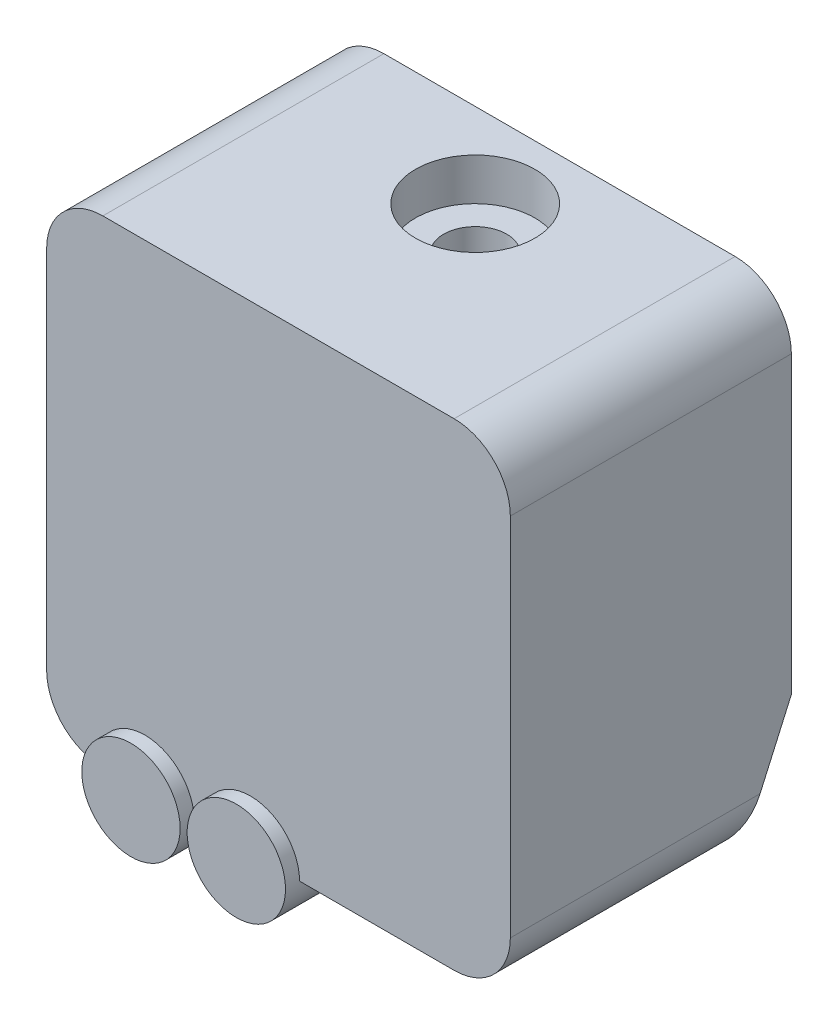
ISO-10303-21;
HEADER;
FILE_DESCRIPTION(('STEP AP214'),'2;1');
FILE_NAME('part.step','',(''),(''),'','','');
FILE_SCHEMA(('AUTOMOTIVE_DESIGN { 1 0 10303 214 1 1 1 1 }'));
ENDSEC;
DATA;
#1=APPLICATION_CONTEXT('core data for automotive mechanical design processes');
#2=APPLICATION_PROTOCOL_DEFINITION('international standard','automotive_design',2000,#1);
#3=PRODUCT_CONTEXT('',#1,'mechanical');
#4=PRODUCT('Part','Part','',(#3));
#5=PRODUCT_RELATED_PRODUCT_CATEGORY('part','',(#4));
#6=PRODUCT_DEFINITION_FORMATION('','',#4);
#7=PRODUCT_DEFINITION_CONTEXT('part definition',#1,'design');
#8=PRODUCT_DEFINITION('design','',#6,#7);
#9=PRODUCT_DEFINITION_SHAPE('','',#8);
#10=(LENGTH_UNIT() NAMED_UNIT(*) SI_UNIT(.MILLI.,.METRE.));
#11=(NAMED_UNIT(*) PLANE_ANGLE_UNIT() SI_UNIT($,.RADIAN.));
#12=(NAMED_UNIT(*) SI_UNIT($,.STERADIAN.) SOLID_ANGLE_UNIT());
#13=UNCERTAINTY_MEASURE_WITH_UNIT(LENGTH_MEASURE(1.E-05),#10,'distance_accuracy_value','');
#14=(GEOMETRIC_REPRESENTATION_CONTEXT(3) GLOBAL_UNCERTAINTY_ASSIGNED_CONTEXT((#13)) GLOBAL_UNIT_ASSIGNED_CONTEXT((#10,
#11,#12)) REPRESENTATION_CONTEXT('',''));
#15=CARTESIAN_POINT('',(0.,0.,0.));
#16=DIRECTION('',(0.,0.,1.));
#17=DIRECTION('',(1.,0.,0.));
#18=AXIS2_PLACEMENT_3D('',#15,#16,#17);
#19=CARTESIAN_POINT('',(0.,60.499,-18.));
#20=DIRECTION('',(0.,1.,0.));
#21=DIRECTION('',(0.,0.,1.));
#22=AXIS2_PLACEMENT_3D('',#19,#20,#21);
#23=CYLINDRICAL_SURFACE('',#22,2.25);
#24=CARTESIAN_POINT('',(0.,93.,-18.));
#25=DIRECTION('',(0.,1.,0.));
#26=DIRECTION('',(0.,0.,1.));
#27=AXIS2_PLACEMENT_3D('',#24,#25,#26);
#28=CIRCLE('',#27,2.25);
#29=CARTESIAN_POINT('',(0.,93.,-15.75));
#30=VERTEX_POINT('',#29);
#31=EDGE_CURVE('E574',#30,#30,#28,.F.);
#32=ORIENTED_EDGE('',*,*,#31,.T.);
#33=EDGE_LOOP('',(#32));
#34=FACE_BOUND('',#33,.T.);
#35=CARTESIAN_POINT('',(0.,95.,-18.));
#36=DIRECTION('',(0.,1.,0.));
#37=DIRECTION('',(0.,0.,1.));
#38=AXIS2_PLACEMENT_3D('',#35,#36,#37);
#39=CIRCLE('',#38,2.25);
#40=CARTESIAN_POINT('',(0.,95.,-15.75));
#41=VERTEX_POINT('',#40);
#42=EDGE_CURVE('E43',#41,#41,#39,.F.);
#43=ORIENTED_EDGE('',*,*,#42,.F.);
#44=EDGE_LOOP('',(#43));
#45=FACE_BOUND('',#44,.T.);
#46=ADVANCED_FACE('F39',(#34,#45),#23,.F.);
#47=CARTESIAN_POINT('',(-50.1130151648151,73.,-24.));
#48=DIRECTION('',(0.,0.406736643075801,0.913545457642601));
#49=DIRECTION('',(0.,-0.913545457642601,0.406736643075801));
#50=AXIS2_PLACEMENT_3D('',#47,#48,#49);
#51=PLANE('',#50);
#52=DIRECTION('',(1.,0.,0.));
#53=VECTOR('',#52,1.);
#54=CARTESIAN_POINT('',(-50.1130151648151,69.,-22.2190852587658));
#55=LINE('',#54,#53);
#56=CARTESIAN_POINT('',(-11.5,69.,-22.2190852587658));
#57=VERTEX_POINT('',#56);
#58=CARTESIAN_POINT('',(11.5,69.,-22.2190852587658));
#59=VERTEX_POINT('',#58);
#60=EDGE_CURVE('E13',#57,#59,#55,.T.);
#61=ORIENTED_EDGE('',*,*,#60,.T.);
#62=DIRECTION('',(0.,0.913545457642601,-0.406736643075801));
#63=VECTOR('',#62,1.);
#64=CARTESIAN_POINT('',(11.5,73.,-24.));
#65=LINE('',#64,#63);
#66=CARTESIAN_POINT('',(11.5,73.,-24.));
#67=VERTEX_POINT('',#66);
#68=EDGE_CURVE('E177',#59,#67,#65,.T.);
#69=ORIENTED_EDGE('',*,*,#68,.T.);
#70=DIRECTION('',(1.,0.,0.));
#71=VECTOR('',#70,1.);
#72=CARTESIAN_POINT('',(-50.1130151648151,73.,-24.));
#73=LINE('',#72,#71);
#74=CARTESIAN_POINT('',(16.5,73.,-24.));
#75=VERTEX_POINT('',#74);
#76=EDGE_CURVE('E213',#67,#75,#73,.T.);
#77=ORIENTED_EDGE('',*,*,#76,.T.);
#78=DIRECTION('',(0.,-0.913545457642601,0.406736643075801));
#79=VECTOR('',#78,1.);
#80=CARTESIAN_POINT('',(16.5,73.,-24.));
#81=LINE('',#80,#79);
#82=CARTESIAN_POINT('',(16.5,68.,-21.7738565734573));
#83=VERTEX_POINT('',#82);
#84=EDGE_CURVE('E204',#75,#83,#81,.T.);
#85=ORIENTED_EDGE('',*,*,#84,.T.);
#86=CARTESIAN_POINT('',(12.5,68.,-21.7738565734573));
#87=DIRECTION('',(0.,-0.406736643075801,-0.9135454576426));
#88=DIRECTION('',(0.,0.913545457642601,-0.406736643075801));
#89=AXIS2_PLACEMENT_3D('',#86,#87,#88);
#90=ELLIPSE('',#89,4.37854511402419,4.);
#91=CARTESIAN_POINT('',(12.5,64.,-19.9929418322231));
#92=VERTEX_POINT('',#91);
#93=EDGE_CURVE('E216',#92,#83,#90,.F.);
#94=ORIENTED_EDGE('',*,*,#93,.F.);
#95=DIRECTION('',(-1.,0.,0.));
#96=VECTOR('',#95,1.);
#97=CARTESIAN_POINT('',(-16.5,64.,-19.9929418322231));
#98=LINE('',#97,#96);
#99=CARTESIAN_POINT('',(1.5,64.,-19.9929418322231));
#100=VERTEX_POINT('',#99);
#101=EDGE_CURVE('E219',#92,#100,#98,.T.);
#102=ORIENTED_EDGE('',*,*,#101,.T.);
#103=CARTESIAN_POINT('',(-2.00000000000001,64.,-19.9929418322231));
#104=DIRECTION('',(0.,-0.406736643075801,-0.9135454576426));
#105=DIRECTION('',(0.,0.913545457642601,-0.406736643075801));
#106=AXIS2_PLACEMENT_3D('',#103,#104,#105);
#107=ELLIPSE('',#106,3.83122697477117,3.50000000000001);
#108=CARTESIAN_POINT('',(-5.50000000000001,64.,-19.9929418322231));
#109=VERTEX_POINT('',#108);
#110=EDGE_CURVE('E221',#100,#109,#107,.T.);
#111=ORIENTED_EDGE('',*,*,#110,.T.);
#112=DIRECTION('',(-1.,0.,0.));
#113=VECTOR('',#112,1.);
#114=CARTESIAN_POINT('',(-16.5,64.,-19.9929418322231));
#115=LINE('',#114,#113);
#116=CARTESIAN_POINT('',(-6.,64.,-19.9929418322231));
#117=VERTEX_POINT('',#116);
#118=EDGE_CURVE('E223',#109,#117,#115,.T.);
#119=ORIENTED_EDGE('',*,*,#118,.T.);
#120=CARTESIAN_POINT('',(-9.50000000000001,64.,-19.9929418322231));
#121=DIRECTION('',(0.,-0.406736643075801,-0.9135454576426));
#122=DIRECTION('',(0.,0.913545457642601,-0.406736643075801));
#123=AXIS2_PLACEMENT_3D('',#120,#121,#122);
#124=ELLIPSE('',#123,3.83122697477117,3.5);
#125=CARTESIAN_POINT('',(-12.9998595461287,64.0313553404035,-20.0069021292084));
#126=VERTEX_POINT('',#125);
#127=EDGE_CURVE('E225',#117,#126,#124,.T.);
#128=ORIENTED_EDGE('',*,*,#127,.T.);
#129=CARTESIAN_POINT('',(-12.5,68.,-21.7738565734573));
#130=DIRECTION('',(0.,-0.406736643075801,-0.9135454576426));
#131=DIRECTION('',(0.,0.913545457642601,-0.406736643075801));
#132=AXIS2_PLACEMENT_3D('',#129,#130,#131);
#133=ELLIPSE('',#132,4.37854511402419,4.);
#134=CARTESIAN_POINT('',(-16.5,68.,-21.7738565734573));
#135=VERTEX_POINT('',#134);
#136=EDGE_CURVE('E227',#135,#126,#133,.F.);
#137=ORIENTED_EDGE('',*,*,#136,.F.);
#138=DIRECTION('',(0.,0.913545457642601,-0.406736643075801));
#139=VECTOR('',#138,1.);
#140=CARTESIAN_POINT('',(-16.5,73.,-24.));
#141=LINE('',#140,#139);
#142=CARTESIAN_POINT('',(-16.5,73.,-24.));
#143=VERTEX_POINT('',#142);
#144=EDGE_CURVE('E210',#135,#143,#141,.T.);
#145=ORIENTED_EDGE('',*,*,#144,.T.);
#146=CARTESIAN_POINT('',(-11.5,73.,-24.));
#147=VERTEX_POINT('',#146);
#148=EDGE_CURVE('E215',#143,#147,#73,.T.);
#149=ORIENTED_EDGE('',*,*,#148,.T.);
#150=DIRECTION('',(0.,-0.913545457642601,0.406736643075801));
#151=VECTOR('',#150,1.);
#152=CARTESIAN_POINT('',(-11.5,73.,-24.));
#153=LINE('',#152,#151);
#154=EDGE_CURVE('E197',#147,#57,#153,.T.);
#155=ORIENTED_EDGE('',*,*,#154,.T.);
#156=EDGE_LOOP('',(#61,#69,#77,#85,#94,#102,#111,#119,#128,#137,#145,#149,#155));
#157=FACE_BOUND('',#156,.T.);
#158=ADVANCED_FACE('F342',(#157),#51,.F.);
#159=CARTESIAN_POINT('',(-50.1130151648151,113.,-24.));
#160=DIRECTION('',(0.,0.,1.));
#161=DIRECTION('',(0.,-1.,0.));
#162=AXIS2_PLACEMENT_3D('',#159,#160,#161);
#163=PLANE('',#162);
#164=ORIENTED_EDGE('',*,*,#76,.F.);
#165=DIRECTION('',(0.,-1.,0.));
#166=VECTOR('',#165,1.);
#167=CARTESIAN_POINT('',(11.5,93.,-24.));
#168=LINE('',#167,#166);
#169=CARTESIAN_POINT('',(11.5,93.,-24.));
#170=VERTEX_POINT('',#169);
#171=EDGE_CURVE('E184',#170,#67,#168,.T.);
#172=ORIENTED_EDGE('',*,*,#171,.F.);
#173=DIRECTION('',(1.,0.,0.));
#174=VECTOR('',#173,1.);
#175=CARTESIAN_POINT('',(11.5,93.,-24.));
#176=LINE('',#175,#174);
#177=CARTESIAN_POINT('',(-11.5,93.,-24.));
#178=VERTEX_POINT('',#177);
#179=EDGE_CURVE('E188',#178,#170,#176,.T.);
#180=ORIENTED_EDGE('',*,*,#179,.F.);
#181=DIRECTION('',(0.,1.,0.));
#182=VECTOR('',#181,1.);
#183=CARTESIAN_POINT('',(-11.5,93.,-24.));
#184=LINE('',#183,#182);
#185=EDGE_CURVE('E182',#147,#178,#184,.T.);
#186=ORIENTED_EDGE('',*,*,#185,.F.);
#187=ORIENTED_EDGE('',*,*,#148,.F.);
#188=DIRECTION('',(0.,1.,0.));
#189=VECTOR('',#188,1.);
#190=CARTESIAN_POINT('',(-16.5,98.,-24.));
#191=LINE('',#190,#189);
#192=CARTESIAN_POINT('',(-16.5,94.,-24.));
#193=VERTEX_POINT('',#192);
#194=EDGE_CURVE('E207',#143,#193,#191,.T.);
#195=ORIENTED_EDGE('',*,*,#194,.T.);
#196=CARTESIAN_POINT('',(-12.5,94.,-24.));
#197=DIRECTION('',(0.,0.,-1.));
#198=DIRECTION('',(-1.,0.,0.));
#199=AXIS2_PLACEMENT_3D('',#196,#197,#198);
#200=CIRCLE('',#199,4.);
#201=CARTESIAN_POINT('',(-12.5,98.,-24.));
#202=VERTEX_POINT('',#201);
#203=EDGE_CURVE('E288',#193,#202,#200,.T.);
#204=ORIENTED_EDGE('',*,*,#203,.T.);
#205=DIRECTION('',(-1.,0.,0.));
#206=VECTOR('',#205,1.);
#207=CARTESIAN_POINT('',(-16.5,98.,-24.));
#208=LINE('',#207,#206);
#209=CARTESIAN_POINT('',(12.5,98.,-24.));
#210=VERTEX_POINT('',#209);
#211=EDGE_CURVE('E245',#210,#202,#208,.T.);
#212=ORIENTED_EDGE('',*,*,#211,.F.);
#213=CARTESIAN_POINT('',(12.5,94.,-24.));
#214=DIRECTION('',(0.,0.,-1.));
#215=DIRECTION('',(-1.,0.,0.));
#216=AXIS2_PLACEMENT_3D('',#213,#214,#215);
#217=CIRCLE('',#216,4.);
#218=CARTESIAN_POINT('',(16.5,94.,-24.));
#219=VERTEX_POINT('',#218);
#220=EDGE_CURVE('E285',#210,#219,#217,.T.);
#221=ORIENTED_EDGE('',*,*,#220,.T.);
#222=DIRECTION('',(0.,-1.,0.));
#223=VECTOR('',#222,1.);
#224=CARTESIAN_POINT('',(16.5,98.,-24.));
#225=LINE('',#224,#223);
#226=EDGE_CURVE('E201',#219,#75,#225,.T.);
#227=ORIENTED_EDGE('',*,*,#226,.T.);
#228=EDGE_LOOP('',(#164,#172,#180,#186,#187,#195,#204,#212,#221,#227));
#229=FACE_BOUND('',#228,.T.);
#230=ADVANCED_FACE('F346',(#229),#163,.F.);
#231=CARTESIAN_POINT('',(-16.5,64.,-3.99999999999999));
#232=DIRECTION('',(0.,1.,0.));
#233=DIRECTION('',(0.,0.,1.));
#234=AXIS2_PLACEMENT_3D('',#231,#232,#233);
#235=PLANE('',#234);
#236=ORIENTED_EDGE('',*,*,#101,.F.);
#237=DIRECTION('',(0.,0.,-1.));
#238=VECTOR('',#237,1.);
#239=CARTESIAN_POINT('',(12.5,64.,-3.99999999999999));
#240=LINE('',#239,#238);
#241=CARTESIAN_POINT('',(12.5,64.,-3.99999999999999));
#242=VERTEX_POINT('',#241);
#243=EDGE_CURVE('E279',#92,#242,#240,.F.);
#244=ORIENTED_EDGE('',*,*,#243,.T.);
#245=DIRECTION('',(1.,0.,0.));
#246=VECTOR('',#245,1.);
#247=CARTESIAN_POINT('',(-16.5,64.,-3.99999999999999));
#248=LINE('',#247,#246);
#249=CARTESIAN_POINT('',(1.5,64.,-3.99999999999999));
#250=VERTEX_POINT('',#249);
#251=EDGE_CURVE('E249',#250,#242,#248,.T.);
#252=ORIENTED_EDGE('',*,*,#251,.F.);
#253=DIRECTION('',(0.,0.,-1.));
#254=VECTOR('',#253,1.);
#255=CARTESIAN_POINT('',(1.5,64.,7.89949493661169));
#256=LINE('',#255,#254);
#257=EDGE_CURVE('E63',#100,#250,#256,.F.);
#258=ORIENTED_EDGE('',*,*,#257,.F.);
#259=EDGE_LOOP('',(#236,#244,#252,#258));
#260=FACE_BOUND('',#259,.T.);
#261=ADVANCED_FACE('F301',(#260),#235,.F.);
#262=ORIENTED_EDGE('',*,*,#118,.F.);
#263=DIRECTION('',(0.,0.,-1.));
#264=VECTOR('',#263,1.);
#265=CARTESIAN_POINT('',(-5.50000000000001,64.,7.89949493661169));
#266=LINE('',#265,#264);
#267=CARTESIAN_POINT('',(-5.50000000000001,64.,-3.99999999999999));
#268=VERTEX_POINT('',#267);
#269=EDGE_CURVE('E233',#268,#109,#266,.T.);
#270=ORIENTED_EDGE('',*,*,#269,.F.);
#271=CARTESIAN_POINT('',(-6.,64.,-3.99999999999999));
#272=VERTEX_POINT('',#271);
#273=EDGE_CURVE('E250',#272,#268,#248,.T.);
#274=ORIENTED_EDGE('',*,*,#273,.F.);
#275=DIRECTION('',(0.,0.,-1.));
#276=VECTOR('',#275,1.);
#277=CARTESIAN_POINT('',(-6.,64.,7.89949493661169));
#278=LINE('',#277,#276);
#279=EDGE_CURVE('E243',#117,#272,#278,.F.);
#280=ORIENTED_EDGE('',*,*,#279,.F.);
#281=EDGE_LOOP('',(#262,#270,#274,#280));
#282=FACE_BOUND('',#281,.T.);
#283=ADVANCED_FACE('F338',(#282),#235,.F.);
#284=CARTESIAN_POINT('',(-12.5,68.,-3.99999999999999));
#285=DIRECTION('',(0.,0.,-1.));
#286=DIRECTION('',(-1.,0.,0.));
#287=AXIS2_PLACEMENT_3D('',#284,#285,#286);
#288=CYLINDRICAL_SURFACE('',#287,4.);
#289=DIRECTION('',(0.,0.,-1.));
#290=VECTOR('',#289,1.);
#291=CARTESIAN_POINT('',(-16.5,68.,-3.99999999999999));
#292=LINE('',#291,#290);
#293=CARTESIAN_POINT('',(-16.5,68.,-3.99999999999999));
#294=VERTEX_POINT('',#293);
#295=EDGE_CURVE('E283',#135,#294,#292,.F.);
#296=ORIENTED_EDGE('',*,*,#295,.F.);
#297=ORIENTED_EDGE('',*,*,#136,.T.);
#298=DIRECTION('',(0.,0.,-1.));
#299=VECTOR('',#298,1.);
#300=CARTESIAN_POINT('',(-12.9998595461287,64.0313553404035,-14.));
#301=LINE('',#300,#299);
#302=CARTESIAN_POINT('',(-12.9998595461287,64.0313553404035,-3.99999999999999));
#303=VERTEX_POINT('',#302);
#304=EDGE_CURVE('E290',#126,#303,#301,.F.);
#305=ORIENTED_EDGE('',*,*,#304,.T.);
#306=CARTESIAN_POINT('',(-12.5,68.,-3.99999999999999));
#307=DIRECTION('',(0.,0.,1.));
#308=DIRECTION('',(1.,0.,0.));
#309=AXIS2_PLACEMENT_3D('',#306,#307,#308);
#310=CIRCLE('',#309,4.);
#311=EDGE_CURVE('E272',#294,#303,#310,.T.);
#312=ORIENTED_EDGE('',*,*,#311,.F.);
#313=EDGE_LOOP('',(#296,#297,#305,#312));
#314=FACE_BOUND('',#313,.T.);
#315=ADVANCED_FACE('F331',(#314),#288,.T.);
#316=CARTESIAN_POINT('',(12.5,68.,-3.99999999999999));
#317=DIRECTION('',(0.,0.,-1.));
#318=DIRECTION('',(-1.,0.,0.));
#319=AXIS2_PLACEMENT_3D('',#316,#317,#318);
#320=CYLINDRICAL_SURFACE('',#319,4.);
#321=ORIENTED_EDGE('',*,*,#243,.F.);
#322=ORIENTED_EDGE('',*,*,#93,.T.);
#323=DIRECTION('',(0.,0.,-1.));
#324=VECTOR('',#323,1.);
#325=CARTESIAN_POINT('',(16.5,68.,-3.99999999999999));
#326=LINE('',#325,#324);
#327=CARTESIAN_POINT('',(16.5,68.,-3.99999999999999));
#328=VERTEX_POINT('',#327);
#329=EDGE_CURVE('E266',#328,#83,#326,.T.);
#330=ORIENTED_EDGE('',*,*,#329,.F.);
#331=CARTESIAN_POINT('',(12.5,68.,-3.99999999999999));
#332=DIRECTION('',(0.,0.,1.));
#333=DIRECTION('',(1.,0.,0.));
#334=AXIS2_PLACEMENT_3D('',#331,#332,#333);
#335=CIRCLE('',#334,4.);
#336=EDGE_CURVE('E275',#242,#328,#335,.T.);
#337=ORIENTED_EDGE('',*,*,#336,.F.);
#338=EDGE_LOOP('',(#321,#322,#330,#337));
#339=FACE_BOUND('',#338,.T.);
#340=ADVANCED_FACE('F304',(#339),#320,.T.);
#341=CARTESIAN_POINT('',(-9.50000000000001,64.,7.89949493661169));
#342=DIRECTION('',(0.,0.,-1.));
#343=DIRECTION('',(-1.,0.,0.));
#344=AXIS2_PLACEMENT_3D('',#341,#342,#343);
#345=CYLINDRICAL_SURFACE('',#344,3.5);
#346=ORIENTED_EDGE('',*,*,#304,.F.);
#347=ORIENTED_EDGE('',*,*,#127,.F.);
#348=ORIENTED_EDGE('',*,*,#279,.T.);
#349=CARTESIAN_POINT('',(-9.50000000000001,64.,-3.99999999999999));
#350=DIRECTION('',(0.,0.,1.));
#351=DIRECTION('',(1.,0.,0.));
#352=AXIS2_PLACEMENT_3D('',#349,#350,#351);
#353=CIRCLE('',#352,3.5);
#354=EDGE_CURVE('E240',#303,#272,#353,.F.);
#355=ORIENTED_EDGE('',*,*,#354,.F.);
#356=EDGE_LOOP('',(#346,#347,#348,#355));
#357=FACE_BOUND('',#356,.T.);
#358=CARTESIAN_POINT('',(-9.50000000000001,64.,-2.99999999999999));
#359=DIRECTION('',(0.,0.,1.));
#360=DIRECTION('',(1.,0.,0.));
#361=AXIS2_PLACEMENT_3D('',#358,#359,#360);
#362=CIRCLE('',#361,3.5);
#363=CARTESIAN_POINT('',(-6.,64.,-2.99999999999999));
#364=VERTEX_POINT('',#363);
#365=EDGE_CURVE('E237',#364,#364,#362,.T.);
#366=ORIENTED_EDGE('',*,*,#365,.F.);
#367=EDGE_LOOP('',(#366));
#368=FACE_BOUND('',#367,.T.);
#369=ADVANCED_FACE('F351',(#357,#368),#345,.T.);
#370=CARTESIAN_POINT('',(-2.00000000000001,64.,7.89949493661169));
#371=DIRECTION('',(0.,0.,-1.));
#372=DIRECTION('',(-1.,0.,0.));
#373=AXIS2_PLACEMENT_3D('',#370,#371,#372);
#374=CYLINDRICAL_SURFACE('',#373,3.50000000000001);
#375=ORIENTED_EDGE('',*,*,#269,.T.);
#376=ORIENTED_EDGE('',*,*,#110,.F.);
#377=ORIENTED_EDGE('',*,*,#257,.T.);
#378=CARTESIAN_POINT('',(-2.00000000000001,64.,-3.99999999999999));
#379=DIRECTION('',(0.,0.,1.));
#380=DIRECTION('',(1.,0.,0.));
#381=AXIS2_PLACEMENT_3D('',#378,#379,#380);
#382=CIRCLE('',#381,3.50000000000001);
#383=EDGE_CURVE('E48',#268,#250,#382,.F.);
#384=ORIENTED_EDGE('',*,*,#383,.F.);
#385=EDGE_LOOP('',(#375,#376,#377,#384));
#386=FACE_BOUND('',#385,.T.);
#387=CARTESIAN_POINT('',(-2.00000000000001,64.,-2.99999999999999));
#388=DIRECTION('',(0.,0.,1.));
#389=DIRECTION('',(1.,0.,0.));
#390=AXIS2_PLACEMENT_3D('',#387,#388,#389);
#391=CIRCLE('',#390,3.50000000000001);
#392=CARTESIAN_POINT('',(1.5,64.,-2.99999999999999));
#393=VERTEX_POINT('',#392);
#394=EDGE_CURVE('E230',#393,#393,#391,.T.);
#395=ORIENTED_EDGE('',*,*,#394,.F.);
#396=EDGE_LOOP('',(#395));
#397=FACE_BOUND('',#396,.T.);
#398=ADVANCED_FACE('F339',(#386,#397),#374,.T.);
#399=CARTESIAN_POINT('',(-16.5,98.,-3.99999999999999));
#400=DIRECTION('',(1.,0.,0.));
#401=DIRECTION('',(0.,0.,-1.));
#402=AXIS2_PLACEMENT_3D('',#399,#400,#401);
#403=PLANE('',#402);
#404=ORIENTED_EDGE('',*,*,#144,.F.);
#405=ORIENTED_EDGE('',*,*,#295,.T.);
#406=DIRECTION('',(0.,-1.,0.));
#407=VECTOR('',#406,1.);
#408=CARTESIAN_POINT('',(-16.5,98.,-3.99999999999999));
#409=LINE('',#408,#407);
#410=CARTESIAN_POINT('',(-16.5,94.,-3.99999999999999));
#411=VERTEX_POINT('',#410);
#412=EDGE_CURVE('E246',#411,#294,#409,.T.);
#413=ORIENTED_EDGE('',*,*,#412,.F.);
#414=DIRECTION('',(0.,0.,-1.));
#415=VECTOR('',#414,1.);
#416=CARTESIAN_POINT('',(-16.5,94.,-3.99999999999999));
#417=LINE('',#416,#415);
#418=EDGE_CURVE('E281',#411,#193,#417,.T.);
#419=ORIENTED_EDGE('',*,*,#418,.T.);
#420=ORIENTED_EDGE('',*,*,#194,.F.);
#421=EDGE_LOOP('',(#404,#405,#413,#419,#420));
#422=FACE_BOUND('',#421,.T.);
#423=ADVANCED_FACE('F328',(#422),#403,.F.);
#424=CARTESIAN_POINT('',(0.,0.,-3.99999999999999));
#425=DIRECTION('',(0.,0.,1.));
#426=DIRECTION('',(1.,0.,0.));
#427=AXIS2_PLACEMENT_3D('',#424,#425,#426);
#428=PLANE('',#427);
#429=ORIENTED_EDGE('',*,*,#273,.T.);
#430=ORIENTED_EDGE('',*,*,#383,.T.);
#431=ORIENTED_EDGE('',*,*,#251,.T.);
#432=ORIENTED_EDGE('',*,*,#336,.T.);
#433=DIRECTION('',(0.,1.,0.));
#434=VECTOR('',#433,1.);
#435=CARTESIAN_POINT('',(16.5,98.,-3.99999999999999));
#436=LINE('',#435,#434);
#437=CARTESIAN_POINT('',(16.5,94.,-3.99999999999999));
#438=VERTEX_POINT('',#437);
#439=EDGE_CURVE('E253',#328,#438,#436,.T.);
#440=ORIENTED_EDGE('',*,*,#439,.T.);
#441=CARTESIAN_POINT('',(12.5,94.,-3.99999999999999));
#442=DIRECTION('',(0.,0.,1.));
#443=DIRECTION('',(1.,0.,0.));
#444=AXIS2_PLACEMENT_3D('',#441,#442,#443);
#445=CIRCLE('',#444,4.);
#446=CARTESIAN_POINT('',(12.5,98.,-3.99999999999999));
#447=VERTEX_POINT('',#446);
#448=EDGE_CURVE('E277',#438,#447,#445,.T.);
#449=ORIENTED_EDGE('',*,*,#448,.T.);
#450=DIRECTION('',(-1.,0.,0.));
#451=VECTOR('',#450,1.);
#452=CARTESIAN_POINT('',(-16.5,98.,-3.99999999999999));
#453=LINE('',#452,#451);
#454=CARTESIAN_POINT('',(-12.5,98.,-3.99999999999999));
#455=VERTEX_POINT('',#454);
#456=EDGE_CURVE('E256',#447,#455,#453,.T.);
#457=ORIENTED_EDGE('',*,*,#456,.T.);
#458=CARTESIAN_POINT('',(-12.5,94.,-3.99999999999999));
#459=DIRECTION('',(0.,0.,1.));
#460=DIRECTION('',(1.,0.,0.));
#461=AXIS2_PLACEMENT_3D('',#458,#459,#460);
#462=CIRCLE('',#461,4.);
#463=EDGE_CURVE('E270',#455,#411,#462,.T.);
#464=ORIENTED_EDGE('',*,*,#463,.T.);
#465=ORIENTED_EDGE('',*,*,#412,.T.);
#466=ORIENTED_EDGE('',*,*,#311,.T.);
#467=ORIENTED_EDGE('',*,*,#354,.T.);
#468=EDGE_LOOP('',(#429,#430,#431,#432,#440,#449,#457,#464,#465,#466,#467));
#469=FACE_BOUND('',#468,.T.);
#470=ADVANCED_FACE('F295',(#469),#428,.T.);
#471=CARTESIAN_POINT('',(16.5,98.,-3.99999999999999));
#472=DIRECTION('',(-1.,0.,0.));
#473=DIRECTION('',(0.,0.,1.));
#474=AXIS2_PLACEMENT_3D('',#471,#472,#473);
#475=PLANE('',#474);
#476=DIRECTION('',(0.,0.,-1.));
#477=VECTOR('',#476,1.);
#478=CARTESIAN_POINT('',(16.5,94.,-3.99999999999999));
#479=LINE('',#478,#477);
#480=EDGE_CURVE('E268',#219,#438,#479,.F.);
#481=ORIENTED_EDGE('',*,*,#480,.T.);
#482=ORIENTED_EDGE('',*,*,#439,.F.);
#483=ORIENTED_EDGE('',*,*,#329,.T.);
#484=ORIENTED_EDGE('',*,*,#84,.F.);
#485=ORIENTED_EDGE('',*,*,#226,.F.);
#486=EDGE_LOOP('',(#481,#482,#483,#484,#485));
#487=FACE_BOUND('',#486,.T.);
#488=ADVANCED_FACE('F309',(#487),#475,.F.);
#489=CARTESIAN_POINT('',(-16.5,98.,-3.99999999999999));
#490=DIRECTION('',(0.,-1.,0.));
#491=DIRECTION('',(0.,0.,-1.));
#492=AXIS2_PLACEMENT_3D('',#489,#490,#491);
#493=PLANE('',#492);
#494=CARTESIAN_POINT('',(0.,98.,-18.));
#495=DIRECTION('',(0.,1.,0.));
#496=DIRECTION('',(0.,0.,1.));
#497=AXIS2_PLACEMENT_3D('',#494,#495,#496);
#498=CIRCLE('',#497,4.25);
#499=CARTESIAN_POINT('',(0.,98.,-13.75));
#500=VERTEX_POINT('',#499);
#501=EDGE_CURVE('E567',#500,#500,#498,.T.);
#502=ORIENTED_EDGE('',*,*,#501,.F.);
#503=EDGE_LOOP('',(#502));
#504=FACE_BOUND('',#503,.T.);
#505=ORIENTED_EDGE('',*,*,#456,.F.);
#506=DIRECTION('',(0.,0.,-1.));
#507=VECTOR('',#506,1.);
#508=CARTESIAN_POINT('',(12.5,98.,-3.99999999999999));
#509=LINE('',#508,#507);
#510=EDGE_CURVE('E263',#447,#210,#509,.T.);
#511=ORIENTED_EDGE('',*,*,#510,.T.);
#512=ORIENTED_EDGE('',*,*,#211,.T.);
#513=DIRECTION('',(0.,0.,-1.));
#514=VECTOR('',#513,1.);
#515=CARTESIAN_POINT('',(-12.5,98.,-3.99999999999999));
#516=LINE('',#515,#514);
#517=EDGE_CURVE('E259',#202,#455,#516,.F.);
#518=ORIENTED_EDGE('',*,*,#517,.T.);
#519=EDGE_LOOP('',(#505,#511,#512,#518));
#520=FACE_BOUND('',#519,.T.);
#521=ADVANCED_FACE('F319',(#504,#520),#493,.F.);
#522=CARTESIAN_POINT('',(12.5,94.,-3.99999999999999));
#523=DIRECTION('',(0.,0.,-1.));
#524=DIRECTION('',(-1.,0.,0.));
#525=AXIS2_PLACEMENT_3D('',#522,#523,#524);
#526=CYLINDRICAL_SURFACE('',#525,4.);
#527=ORIENTED_EDGE('',*,*,#448,.F.);
#528=ORIENTED_EDGE('',*,*,#480,.F.);
#529=ORIENTED_EDGE('',*,*,#220,.F.);
#530=ORIENTED_EDGE('',*,*,#510,.F.);
#531=EDGE_LOOP('',(#527,#528,#529,#530));
#532=FACE_BOUND('',#531,.T.);
#533=ADVANCED_FACE('F314',(#532),#526,.T.);
#534=CARTESIAN_POINT('',(-12.5,94.,-3.99999999999999));
#535=DIRECTION('',(0.,0.,-1.));
#536=DIRECTION('',(-1.,0.,0.));
#537=AXIS2_PLACEMENT_3D('',#534,#535,#536);
#538=CYLINDRICAL_SURFACE('',#537,4.);
#539=ORIENTED_EDGE('',*,*,#463,.F.);
#540=ORIENTED_EDGE('',*,*,#517,.F.);
#541=ORIENTED_EDGE('',*,*,#203,.F.);
#542=ORIENTED_EDGE('',*,*,#418,.F.);
#543=EDGE_LOOP('',(#539,#540,#541,#542));
#544=FACE_BOUND('',#543,.T.);
#545=ADVANCED_FACE('F41',(#544),#538,.T.);
#546=CARTESIAN_POINT('',(0.,0.,-2.99999999999999));
#547=DIRECTION('',(0.,0.,1.));
#548=DIRECTION('',(1.,0.,0.));
#549=AXIS2_PLACEMENT_3D('',#546,#547,#548);
#550=PLANE('',#549);
#551=ORIENTED_EDGE('',*,*,#365,.T.);
#552=EDGE_LOOP('',(#551));
#553=FACE_BOUND('',#552,.T.);
#554=ADVANCED_FACE('F357',(#553),#550,.T.);
#555=CARTESIAN_POINT('',(0.,0.,-2.99999999999999));
#556=DIRECTION('',(0.,0.,1.));
#557=DIRECTION('',(1.,0.,0.));
#558=AXIS2_PLACEMENT_3D('',#555,#556,#557);
#559=PLANE('',#558);
#560=ORIENTED_EDGE('',*,*,#394,.T.);
#561=EDGE_LOOP('',(#560));
#562=FACE_BOUND('',#561,.T.);
#563=ADVANCED_FACE('F359',(#562),#559,.T.);
#564=CARTESIAN_POINT('',(11.5,69.,29.2415402771893));
#565=DIRECTION('',(0.,-1.,0.));
#566=DIRECTION('',(0.,0.,-1.));
#567=AXIS2_PLACEMENT_3D('',#564,#565,#566);
#568=PLANE('',#567);
#569=DIRECTION('',(0.,0.,-1.));
#570=VECTOR('',#569,1.);
#571=CARTESIAN_POINT('',(-11.5,69.,29.2415402771893));
#572=LINE('',#571,#570);
#573=CARTESIAN_POINT('',(-11.5,69.,-8.99999999999999));
#574=VERTEX_POINT('',#573);
#575=EDGE_CURVE('E167',#574,#57,#572,.T.);
#576=ORIENTED_EDGE('',*,*,#575,.F.);
#577=DIRECTION('',(-1.,0.,0.));
#578=VECTOR('',#577,1.);
#579=CARTESIAN_POINT('',(11.5,69.,-8.99999999999999));
#580=LINE('',#579,#578);
#581=CARTESIAN_POINT('',(11.5,69.,-8.99999999999999));
#582=VERTEX_POINT('',#581);
#583=EDGE_CURVE('E162',#582,#574,#580,.T.);
#584=ORIENTED_EDGE('',*,*,#583,.F.);
#585=DIRECTION('',(0.,0.,-1.));
#586=VECTOR('',#585,1.);
#587=CARTESIAN_POINT('',(11.5,69.,29.2415402771893));
#588=LINE('',#587,#586);
#589=EDGE_CURVE('E165',#582,#59,#588,.T.);
#590=ORIENTED_EDGE('',*,*,#589,.T.);
#591=ORIENTED_EDGE('',*,*,#60,.F.);
#592=EDGE_LOOP('',(#576,#584,#590,#591));
#593=FACE_BOUND('',#592,.T.);
#594=ADVANCED_FACE('F164',(#593),#568,.F.);
#595=CARTESIAN_POINT('',(11.5,93.,29.2415402771893));
#596=DIRECTION('',(1.,0.,0.));
#597=DIRECTION('',(0.,0.,-1.));
#598=AXIS2_PLACEMENT_3D('',#595,#596,#597);
#599=PLANE('',#598);
#600=ORIENTED_EDGE('',*,*,#589,.F.);
#601=DIRECTION('',(0.,-1.,0.));
#602=VECTOR('',#601,1.);
#603=CARTESIAN_POINT('',(11.5,93.,-8.99999999999999));
#604=LINE('',#603,#602);
#605=CARTESIAN_POINT('',(11.5,93.,-8.99999999999999));
#606=VERTEX_POINT('',#605);
#607=EDGE_CURVE('E174',#606,#582,#604,.T.);
#608=ORIENTED_EDGE('',*,*,#607,.F.);
#609=DIRECTION('',(0.,0.,-1.));
#610=VECTOR('',#609,1.);
#611=CARTESIAN_POINT('',(11.5,93.,29.2415402771893));
#612=LINE('',#611,#610);
#613=EDGE_CURVE('E191',#606,#170,#612,.T.);
#614=ORIENTED_EDGE('',*,*,#613,.T.);
#615=ORIENTED_EDGE('',*,*,#171,.T.);
#616=ORIENTED_EDGE('',*,*,#68,.F.);
#617=EDGE_LOOP('',(#600,#608,#614,#615,#616));
#618=FACE_BOUND('',#617,.T.);
#619=ADVANCED_FACE('F173',(#618),#599,.F.);
#620=CARTESIAN_POINT('',(-11.5,93.,29.2415402771893));
#621=DIRECTION('',(-1.,0.,0.));
#622=DIRECTION('',(0.,0.,1.));
#623=AXIS2_PLACEMENT_3D('',#620,#621,#622);
#624=PLANE('',#623);
#625=ORIENTED_EDGE('',*,*,#185,.T.);
#626=DIRECTION('',(0.,0.,-1.));
#627=VECTOR('',#626,1.);
#628=CARTESIAN_POINT('',(-11.5,93.,29.2415402771893));
#629=LINE('',#628,#627);
#630=CARTESIAN_POINT('',(-11.5,93.,-8.99999999999999));
#631=VERTEX_POINT('',#630);
#632=EDGE_CURVE('E55',#631,#178,#629,.T.);
#633=ORIENTED_EDGE('',*,*,#632,.F.);
#634=DIRECTION('',(0.,1.,0.));
#635=VECTOR('',#634,1.);
#636=CARTESIAN_POINT('',(-11.5,93.,-8.99999999999999));
#637=LINE('',#636,#635);
#638=EDGE_CURVE('E192',#574,#631,#637,.T.);
#639=ORIENTED_EDGE('',*,*,#638,.F.);
#640=ORIENTED_EDGE('',*,*,#575,.T.);
#641=ORIENTED_EDGE('',*,*,#154,.F.);
#642=EDGE_LOOP('',(#625,#633,#639,#640,#641));
#643=FACE_BOUND('',#642,.T.);
#644=ADVANCED_FACE('F386',(#643),#624,.F.);
#645=CARTESIAN_POINT('',(0.,0.,-8.99999999999999));
#646=DIRECTION('',(0.,0.,1.));
#647=DIRECTION('',(1.,0.,0.));
#648=AXIS2_PLACEMENT_3D('',#645,#646,#647);
#649=PLANE('',#648);
#650=DIRECTION('',(1.,0.,0.));
#651=VECTOR('',#650,1.);
#652=CARTESIAN_POINT('',(11.5,93.,-8.99999999999999));
#653=LINE('',#652,#651);
#654=EDGE_CURVE('E180',#631,#606,#653,.T.);
#655=ORIENTED_EDGE('',*,*,#654,.T.);
#656=ORIENTED_EDGE('',*,*,#607,.T.);
#657=ORIENTED_EDGE('',*,*,#583,.T.);
#658=ORIENTED_EDGE('',*,*,#638,.T.);
#659=EDGE_LOOP('',(#655,#656,#657,#658));
#660=FACE_BOUND('',#659,.T.);
#661=ADVANCED_FACE('F179',(#660),#649,.F.);
#662=CARTESIAN_POINT('',(11.5,93.,29.2415402771893));
#663=DIRECTION('',(0.,1.,0.));
#664=DIRECTION('',(0.,0.,1.));
#665=AXIS2_PLACEMENT_3D('',#662,#663,#664);
#666=PLANE('',#665);
#667=ORIENTED_EDGE('',*,*,#31,.F.);
#668=EDGE_LOOP('',(#667));
#669=FACE_BOUND('',#668,.T.);
#670=ORIENTED_EDGE('',*,*,#632,.T.);
#671=ORIENTED_EDGE('',*,*,#179,.T.);
#672=ORIENTED_EDGE('',*,*,#613,.F.);
#673=ORIENTED_EDGE('',*,*,#654,.F.);
#674=EDGE_LOOP('',(#670,#671,#672,#673));
#675=FACE_BOUND('',#674,.T.);
#676=ADVANCED_FACE('F381',(#669,#675),#666,.F.);
#677=CARTESIAN_POINT('',(0.,95.,-18.));
#678=DIRECTION('',(0.,1.,0.));
#679=DIRECTION('',(0.,0.,1.));
#680=AXIS2_PLACEMENT_3D('',#677,#678,#679);
#681=PLANE('',#680);
#682=CARTESIAN_POINT('',(0.,95.,-18.));
#683=DIRECTION('',(0.,1.,0.));
#684=DIRECTION('',(0.,0.,1.));
#685=AXIS2_PLACEMENT_3D('',#682,#683,#684);
#686=CIRCLE('',#685,4.25);
#687=CARTESIAN_POINT('',(0.,95.,-13.75));
#688=VERTEX_POINT('',#687);
#689=EDGE_CURVE('E569',#688,#688,#686,.T.);
#690=ORIENTED_EDGE('',*,*,#689,.T.);
#691=EDGE_LOOP('',(#690));
#692=FACE_BOUND('',#691,.T.);
#693=ORIENTED_EDGE('',*,*,#42,.T.);
#694=EDGE_LOOP('',(#693));
#695=FACE_BOUND('',#694,.T.);
#696=ADVANCED_FACE('F384',(#692,#695),#681,.T.);
#697=CARTESIAN_POINT('',(0.,95.,-18.));
#698=DIRECTION('',(0.,1.,0.));
#699=DIRECTION('',(0.,0.,1.));
#700=AXIS2_PLACEMENT_3D('',#697,#698,#699);
#701=CYLINDRICAL_SURFACE('',#700,4.25);
#702=ORIENTED_EDGE('',*,*,#689,.F.);
#703=EDGE_LOOP('',(#702));
#704=FACE_BOUND('',#703,.T.);
#705=ORIENTED_EDGE('',*,*,#501,.T.);
#706=EDGE_LOOP('',(#705));
#707=FACE_BOUND('',#706,.T.);
#708=ADVANCED_FACE('F379',(#704,#707),#701,.F.);
#709=CLOSED_SHELL('',(#46,#158,#230,#261,#283,#315,#340,#369,#398,#423,#470,#488,#521,#533,#545,
#554,#563,#594,#619,#644,#661,#676,#696,#708));
#710=MANIFOLD_SOLID_BREP('B2',#709);
#711=ADVANCED_BREP_SHAPE_REPRESENTATION('',(#18,#710),#14);
#712=SHAPE_DEFINITION_REPRESENTATION(#9,#711);
ENDSEC;
END-ISO-10303-21;
